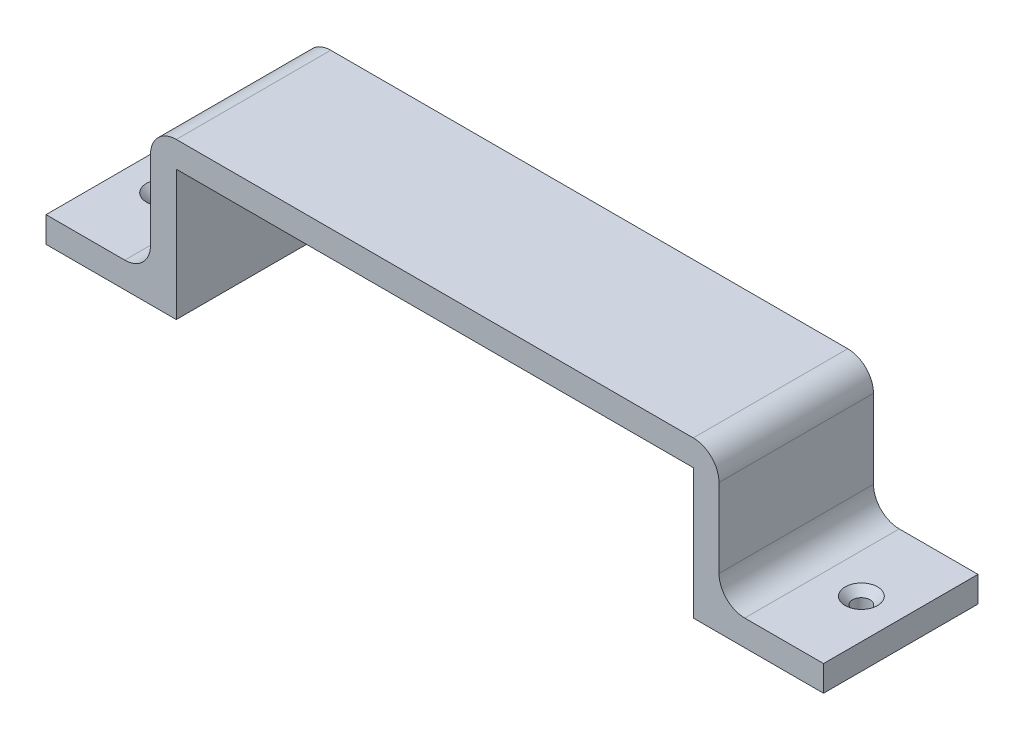
ISO-10303-21;
HEADER;
FILE_DESCRIPTION(('STEP AP214'),'2;1');
FILE_NAME('part.step','',(''),(''),'','','');
FILE_SCHEMA(('AUTOMOTIVE_DESIGN { 1 0 10303 214 1 1 1 1 }'));
ENDSEC;
DATA;
#1=APPLICATION_CONTEXT('core data for automotive mechanical design processes');
#2=APPLICATION_PROTOCOL_DEFINITION('international standard','automotive_design',2000,#1);
#3=PRODUCT_CONTEXT('',#1,'mechanical');
#4=PRODUCT('Part','Part','',(#3));
#5=PRODUCT_RELATED_PRODUCT_CATEGORY('part','',(#4));
#6=PRODUCT_DEFINITION_FORMATION('','',#4);
#7=PRODUCT_DEFINITION_CONTEXT('part definition',#1,'design');
#8=PRODUCT_DEFINITION('design','',#6,#7);
#9=PRODUCT_DEFINITION_SHAPE('','',#8);
#10=(LENGTH_UNIT() NAMED_UNIT(*) SI_UNIT(.MILLI.,.METRE.));
#11=(NAMED_UNIT(*) PLANE_ANGLE_UNIT() SI_UNIT($,.RADIAN.));
#12=(NAMED_UNIT(*) SI_UNIT($,.STERADIAN.) SOLID_ANGLE_UNIT());
#13=UNCERTAINTY_MEASURE_WITH_UNIT(LENGTH_MEASURE(1.E-05),#10,'distance_accuracy_value','');
#14=(GEOMETRIC_REPRESENTATION_CONTEXT(3) GLOBAL_UNCERTAINTY_ASSIGNED_CONTEXT((#13)) GLOBAL_UNIT_ASSIGNED_CONTEXT((#10,
#11,#12)) REPRESENTATION_CONTEXT('',''));
#15=CARTESIAN_POINT('',(0.,0.,0.));
#16=DIRECTION('',(0.,0.,1.));
#17=DIRECTION('',(1.,0.,0.));
#18=AXIS2_PLACEMENT_3D('',#15,#16,#17);
#19=CARTESIAN_POINT('',(-50.2,-25.3,30.));
#20=DIRECTION('',(0.,1.,0.));
#21=DIRECTION('',(-1.,0.,0.));
#22=AXIS2_PLACEMENT_3D('',#19,#20,#21);
#23=PLANE('',#22);
#24=CARTESIAN_POINT('',(-67.85,-25.3,15.));
#25=DIRECTION('',(0.,1.,0.));
#26=DIRECTION('',(0.,0.,1.));
#27=AXIS2_PLACEMENT_3D('',#24,#25,#26);
#28=CIRCLE('',#27,1.69999999999999);
#29=CARTESIAN_POINT('',(-67.85,-25.3,16.7));
#30=VERTEX_POINT('',#29);
#31=EDGE_CURVE('E309',#30,#30,#28,.T.);
#32=ORIENTED_EDGE('',*,*,#31,.T.);
#33=EDGE_LOOP('',(#32));
#34=FACE_BOUND('',#33,.T.);
#35=DIRECTION('',(1.,0.,0.));
#36=VECTOR('',#35,1.);
#37=CARTESIAN_POINT('',(-50.2,-25.3,0.));
#38=LINE('',#37,#36);
#39=CARTESIAN_POINT('',(-75.5,-25.3,0.));
#40=VERTEX_POINT('',#39);
#41=CARTESIAN_POINT('',(-50.2,-25.3,0.));
#42=VERTEX_POINT('',#41);
#43=EDGE_CURVE('E169',#40,#42,#38,.T.);
#44=ORIENTED_EDGE('',*,*,#43,.T.);
#45=DIRECTION('',(0.,0.,-1.));
#46=VECTOR('',#45,1.);
#47=CARTESIAN_POINT('',(-50.2,-25.3,30.));
#48=LINE('',#47,#46);
#49=CARTESIAN_POINT('',(-50.2,-25.3,30.));
#50=VERTEX_POINT('',#49);
#51=EDGE_CURVE('E151',#50,#42,#48,.T.);
#52=ORIENTED_EDGE('',*,*,#51,.F.);
#53=DIRECTION('',(1.,0.,0.));
#54=VECTOR('',#53,1.);
#55=CARTESIAN_POINT('',(-50.2,-25.3,30.));
#56=LINE('',#55,#54);
#57=CARTESIAN_POINT('',(-75.5,-25.3,30.));
#58=VERTEX_POINT('',#57);
#59=EDGE_CURVE('E157',#58,#50,#56,.T.);
#60=ORIENTED_EDGE('',*,*,#59,.F.);
#61=DIRECTION('',(0.,0.,-1.));
#62=VECTOR('',#61,1.);
#63=CARTESIAN_POINT('',(-75.5,-25.3,30.));
#64=LINE('',#63,#62);
#65=EDGE_CURVE('E247',#58,#40,#64,.T.);
#66=ORIENTED_EDGE('',*,*,#65,.T.);
#67=EDGE_LOOP('',(#44,#52,#60,#66));
#68=FACE_BOUND('',#67,.T.);
#69=ADVANCED_FACE('F33',(#34,#68),#23,.F.);
#70=CARTESIAN_POINT('',(-50.2,0.,30.));
#71=DIRECTION('',(-1.,0.,0.));
#72=DIRECTION('',(0.,0.,1.));
#73=AXIS2_PLACEMENT_3D('',#70,#71,#72);
#74=PLANE('',#73);
#75=DIRECTION('',(0.,1.,0.));
#76=VECTOR('',#75,1.);
#77=CARTESIAN_POINT('',(-50.2,0.,0.));
#78=LINE('',#77,#76);
#79=CARTESIAN_POINT('',(-50.2,0.,0.));
#80=VERTEX_POINT('',#79);
#81=EDGE_CURVE('E249',#42,#80,#78,.T.);
#82=ORIENTED_EDGE('',*,*,#81,.T.);
#83=DIRECTION('',(0.,0.,-1.));
#84=VECTOR('',#83,1.);
#85=CARTESIAN_POINT('',(-50.2,0.,30.));
#86=LINE('',#85,#84);
#87=CARTESIAN_POINT('',(-50.2,0.,30.));
#88=VERTEX_POINT('',#87);
#89=EDGE_CURVE('E154',#88,#80,#86,.T.);
#90=ORIENTED_EDGE('',*,*,#89,.F.);
#91=DIRECTION('',(0.,1.,0.));
#92=VECTOR('',#91,1.);
#93=CARTESIAN_POINT('',(-50.2,0.,30.));
#94=LINE('',#93,#92);
#95=EDGE_CURVE('E147',#50,#88,#94,.T.);
#96=ORIENTED_EDGE('',*,*,#95,.F.);
#97=ORIENTED_EDGE('',*,*,#51,.T.);
#98=EDGE_LOOP('',(#82,#90,#96,#97));
#99=FACE_BOUND('',#98,.T.);
#100=ADVANCED_FACE('F149',(#99),#74,.F.);
#101=CARTESIAN_POINT('',(-50.2,0.,30.));
#102=DIRECTION('',(0.,1.,0.));
#103=DIRECTION('',(0.,0.,1.));
#104=AXIS2_PLACEMENT_3D('',#101,#102,#103);
#105=PLANE('',#104);
#106=DIRECTION('',(1.,0.,0.));
#107=VECTOR('',#106,1.);
#108=CARTESIAN_POINT('',(-50.2,0.,0.));
#109=LINE('',#108,#107);
#110=CARTESIAN_POINT('',(50.2,0.,0.));
#111=VERTEX_POINT('',#110);
#112=EDGE_CURVE('E252',#80,#111,#109,.T.);
#113=ORIENTED_EDGE('',*,*,#112,.T.);
#114=DIRECTION('',(0.,0.,-1.));
#115=VECTOR('',#114,1.);
#116=CARTESIAN_POINT('',(50.2,0.,30.));
#117=LINE('',#116,#115);
#118=CARTESIAN_POINT('',(50.2,0.,30.));
#119=VERTEX_POINT('',#118);
#120=EDGE_CURVE('E175',#119,#111,#117,.T.);
#121=ORIENTED_EDGE('',*,*,#120,.F.);
#122=DIRECTION('',(1.,0.,0.));
#123=VECTOR('',#122,1.);
#124=CARTESIAN_POINT('',(-50.2,0.,30.));
#125=LINE('',#124,#123);
#126=EDGE_CURVE('E156',#88,#119,#125,.T.);
#127=ORIENTED_EDGE('',*,*,#126,.F.);
#128=ORIENTED_EDGE('',*,*,#89,.T.);
#129=EDGE_LOOP('',(#113,#121,#127,#128));
#130=FACE_BOUND('',#129,.T.);
#131=ADVANCED_FACE('F359',(#130),#105,.F.);
#132=CARTESIAN_POINT('',(50.2,0.,30.));
#133=DIRECTION('',(1.,0.,0.));
#134=DIRECTION('',(0.,0.,-1.));
#135=AXIS2_PLACEMENT_3D('',#132,#133,#134);
#136=PLANE('',#135);
#137=DIRECTION('',(0.,-1.,0.));
#138=VECTOR('',#137,1.);
#139=CARTESIAN_POINT('',(50.2,0.,0.));
#140=LINE('',#139,#138);
#141=CARTESIAN_POINT('',(50.2,-25.3,0.));
#142=VERTEX_POINT('',#141);
#143=EDGE_CURVE('E254',#111,#142,#140,.T.);
#144=ORIENTED_EDGE('',*,*,#143,.T.);
#145=DIRECTION('',(0.,0.,-1.));
#146=VECTOR('',#145,1.);
#147=CARTESIAN_POINT('',(50.2,-25.3,30.));
#148=LINE('',#147,#146);
#149=CARTESIAN_POINT('',(50.2,-25.3,30.));
#150=VERTEX_POINT('',#149);
#151=EDGE_CURVE('E276',#150,#142,#148,.T.);
#152=ORIENTED_EDGE('',*,*,#151,.F.);
#153=DIRECTION('',(0.,-1.,0.));
#154=VECTOR('',#153,1.);
#155=CARTESIAN_POINT('',(50.2,0.,30.));
#156=LINE('',#155,#154);
#157=EDGE_CURVE('E285',#119,#150,#156,.T.);
#158=ORIENTED_EDGE('',*,*,#157,.F.);
#159=ORIENTED_EDGE('',*,*,#120,.T.);
#160=EDGE_LOOP('',(#144,#152,#158,#159));
#161=FACE_BOUND('',#160,.T.);
#162=ADVANCED_FACE('F283',(#161),#136,.F.);
#163=CARTESIAN_POINT('',(50.2,-25.3,30.));
#164=DIRECTION('',(0.,1.,0.));
#165=DIRECTION('',(-1.,0.,0.));
#166=AXIS2_PLACEMENT_3D('',#163,#164,#165);
#167=PLANE('',#166);
#168=CARTESIAN_POINT('',(67.85,-25.3,15.));
#169=DIRECTION('',(0.,1.,0.));
#170=DIRECTION('',(0.,0.,1.));
#171=AXIS2_PLACEMENT_3D('',#168,#169,#170);
#172=CIRCLE('',#171,1.69999999999999);
#173=CARTESIAN_POINT('',(67.85,-25.3,16.7));
#174=VERTEX_POINT('',#173);
#175=EDGE_CURVE('E250',#174,#174,#172,.T.);
#176=ORIENTED_EDGE('',*,*,#175,.T.);
#177=EDGE_LOOP('',(#176));
#178=FACE_BOUND('',#177,.T.);
#179=DIRECTION('',(1.,0.,0.));
#180=VECTOR('',#179,1.);
#181=CARTESIAN_POINT('',(50.2,-25.3,0.));
#182=LINE('',#181,#180);
#183=CARTESIAN_POINT('',(75.5,-25.3,0.));
#184=VERTEX_POINT('',#183);
#185=EDGE_CURVE('E256',#142,#184,#182,.T.);
#186=ORIENTED_EDGE('',*,*,#185,.T.);
#187=DIRECTION('',(0.,0.,-1.));
#188=VECTOR('',#187,1.);
#189=CARTESIAN_POINT('',(75.5,-25.3,30.));
#190=LINE('',#189,#188);
#191=CARTESIAN_POINT('',(75.5,-25.3,30.));
#192=VERTEX_POINT('',#191);
#193=EDGE_CURVE('E273',#192,#184,#190,.T.);
#194=ORIENTED_EDGE('',*,*,#193,.F.);
#195=DIRECTION('',(1.,0.,0.));
#196=VECTOR('',#195,1.);
#197=CARTESIAN_POINT('',(50.2,-25.3,30.));
#198=LINE('',#197,#196);
#199=EDGE_CURVE('E296',#150,#192,#198,.T.);
#200=ORIENTED_EDGE('',*,*,#199,.F.);
#201=ORIENTED_EDGE('',*,*,#151,.T.);
#202=EDGE_LOOP('',(#186,#194,#200,#201));
#203=FACE_BOUND('',#202,.T.);
#204=ADVANCED_FACE('F291',(#178,#203),#167,.F.);
#205=CARTESIAN_POINT('',(75.5,-25.3,30.));
#206=DIRECTION('',(-1.,0.,0.));
#207=DIRECTION('',(0.,0.,1.));
#208=AXIS2_PLACEMENT_3D('',#205,#206,#207);
#209=PLANE('',#208);
#210=DIRECTION('',(0.,1.,0.));
#211=VECTOR('',#210,1.);
#212=CARTESIAN_POINT('',(75.5,-25.3,0.));
#213=LINE('',#212,#211);
#214=CARTESIAN_POINT('',(75.5,-20.3,0.));
#215=VERTEX_POINT('',#214);
#216=EDGE_CURVE('E224',#184,#215,#213,.T.);
#217=ORIENTED_EDGE('',*,*,#216,.T.);
#218=DIRECTION('',(0.,0.,-1.));
#219=VECTOR('',#218,1.);
#220=CARTESIAN_POINT('',(75.5,-20.3,30.));
#221=LINE('',#220,#219);
#222=CARTESIAN_POINT('',(75.5,-20.3,30.));
#223=VERTEX_POINT('',#222);
#224=EDGE_CURVE('E223',#223,#215,#221,.T.);
#225=ORIENTED_EDGE('',*,*,#224,.F.);
#226=DIRECTION('',(0.,1.,0.));
#227=VECTOR('',#226,1.);
#228=CARTESIAN_POINT('',(75.5,-25.3,30.));
#229=LINE('',#228,#227);
#230=EDGE_CURVE('E238',#192,#223,#229,.T.);
#231=ORIENTED_EDGE('',*,*,#230,.F.);
#232=ORIENTED_EDGE('',*,*,#193,.T.);
#233=EDGE_LOOP('',(#217,#225,#231,#232));
#234=FACE_BOUND('',#233,.T.);
#235=ADVANCED_FACE('F295',(#234),#209,.F.);
#236=CARTESIAN_POINT('',(55.2,-20.3,30.));
#237=DIRECTION('',(0.,-1.,0.));
#238=DIRECTION('',(0.,0.,-1.));
#239=AXIS2_PLACEMENT_3D('',#236,#237,#238);
#240=PLANE('',#239);
#241=CARTESIAN_POINT('',(67.85,-20.3,15.));
#242=DIRECTION('',(0.,1.,0.));
#243=DIRECTION('',(0.,0.,1.));
#244=AXIS2_PLACEMENT_3D('',#241,#242,#243);
#245=CIRCLE('',#244,3.15);
#246=CARTESIAN_POINT('',(67.85,-20.3,18.15));
#247=VERTEX_POINT('',#246);
#248=EDGE_CURVE('E306',#247,#247,#245,.T.);
#249=ORIENTED_EDGE('',*,*,#248,.F.);
#250=EDGE_LOOP('',(#249));
#251=FACE_BOUND('',#250,.T.);
#252=DIRECTION('',(-1.,0.,0.));
#253=VECTOR('',#252,1.);
#254=CARTESIAN_POINT('',(55.2,-20.3,0.));
#255=LINE('',#254,#253);
#256=CARTESIAN_POINT('',(60.2,-20.3,0.));
#257=VERTEX_POINT('',#256);
#258=EDGE_CURVE('E211',#215,#257,#255,.T.);
#259=ORIENTED_EDGE('',*,*,#258,.T.);
#260=DIRECTION('',(0.,0.,-1.));
#261=VECTOR('',#260,1.);
#262=CARTESIAN_POINT('',(60.2,-20.3,30.));
#263=LINE('',#262,#261);
#264=CARTESIAN_POINT('',(60.2,-20.3,30.));
#265=VERTEX_POINT('',#264);
#266=EDGE_CURVE('E188',#257,#265,#263,.F.);
#267=ORIENTED_EDGE('',*,*,#266,.T.);
#268=DIRECTION('',(-1.,0.,0.));
#269=VECTOR('',#268,1.);
#270=CARTESIAN_POINT('',(55.2,-20.3,30.));
#271=LINE('',#270,#269);
#272=EDGE_CURVE('E230',#223,#265,#271,.T.);
#273=ORIENTED_EDGE('',*,*,#272,.F.);
#274=ORIENTED_EDGE('',*,*,#224,.T.);
#275=EDGE_LOOP('',(#259,#267,#273,#274));
#276=FACE_BOUND('',#275,.T.);
#277=ADVANCED_FACE('F219',(#251,#276),#240,.F.);
#278=CARTESIAN_POINT('',(55.2,5.,30.));
#279=DIRECTION('',(-1.,0.,0.));
#280=DIRECTION('',(0.,0.,1.));
#281=AXIS2_PLACEMENT_3D('',#278,#279,#280);
#282=PLANE('',#281);
#283=DIRECTION('',(0.,1.,0.));
#284=VECTOR('',#283,1.);
#285=CARTESIAN_POINT('',(55.2,5.,30.));
#286=LINE('',#285,#284);
#287=CARTESIAN_POINT('',(55.2,-15.3,30.));
#288=VERTEX_POINT('',#287);
#289=CARTESIAN_POINT('',(55.2,0.,30.));
#290=VERTEX_POINT('',#289);
#291=EDGE_CURVE('E229',#288,#290,#286,.T.);
#292=ORIENTED_EDGE('',*,*,#291,.F.);
#293=DIRECTION('',(0.,0.,-1.));
#294=VECTOR('',#293,1.);
#295=CARTESIAN_POINT('',(55.2,-15.3,0.));
#296=LINE('',#295,#294);
#297=CARTESIAN_POINT('',(55.2,-15.3,0.));
#298=VERTEX_POINT('',#297);
#299=EDGE_CURVE('E185',#288,#298,#296,.T.);
#300=ORIENTED_EDGE('',*,*,#299,.T.);
#301=DIRECTION('',(0.,1.,0.));
#302=VECTOR('',#301,1.);
#303=CARTESIAN_POINT('',(55.2,5.,0.));
#304=LINE('',#303,#302);
#305=CARTESIAN_POINT('',(55.2,0.,0.));
#306=VERTEX_POINT('',#305);
#307=EDGE_CURVE('E213',#298,#306,#304,.T.);
#308=ORIENTED_EDGE('',*,*,#307,.T.);
#309=DIRECTION('',(0.,0.,-1.));
#310=VECTOR('',#309,1.);
#311=CARTESIAN_POINT('',(55.2,0.,30.));
#312=LINE('',#311,#310);
#313=EDGE_CURVE('E183',#306,#290,#312,.F.);
#314=ORIENTED_EDGE('',*,*,#313,.T.);
#315=EDGE_LOOP('',(#292,#300,#308,#314));
#316=FACE_BOUND('',#315,.T.);
#317=ADVANCED_FACE('F232',(#316),#282,.F.);
#318=CARTESIAN_POINT('',(-55.2,5.,30.));
#319=DIRECTION('',(0.,-1.,0.));
#320=DIRECTION('',(0.,0.,-1.));
#321=AXIS2_PLACEMENT_3D('',#318,#319,#320);
#322=PLANE('',#321);
#323=DIRECTION('',(-1.,0.,0.));
#324=VECTOR('',#323,1.);
#325=CARTESIAN_POINT('',(-55.2,5.,30.));
#326=LINE('',#325,#324);
#327=CARTESIAN_POINT('',(50.2,5.,30.));
#328=VERTEX_POINT('',#327);
#329=CARTESIAN_POINT('',(-50.2,5.,30.));
#330=VERTEX_POINT('',#329);
#331=EDGE_CURVE('E234',#328,#330,#326,.T.);
#332=ORIENTED_EDGE('',*,*,#331,.F.);
#333=DIRECTION('',(0.,0.,-1.));
#334=VECTOR('',#333,1.);
#335=CARTESIAN_POINT('',(50.2,5.,30.));
#336=LINE('',#335,#334);
#337=CARTESIAN_POINT('',(50.2,5.,0.));
#338=VERTEX_POINT('',#337);
#339=EDGE_CURVE('E191',#328,#338,#336,.T.);
#340=ORIENTED_EDGE('',*,*,#339,.T.);
#341=DIRECTION('',(-1.,0.,0.));
#342=VECTOR('',#341,1.);
#343=CARTESIAN_POINT('',(-55.2,5.,0.));
#344=LINE('',#343,#342);
#345=CARTESIAN_POINT('',(-50.2,5.,0.));
#346=VERTEX_POINT('',#345);
#347=EDGE_CURVE('E260',#338,#346,#344,.T.);
#348=ORIENTED_EDGE('',*,*,#347,.T.);
#349=DIRECTION('',(0.,0.,-1.));
#350=VECTOR('',#349,1.);
#351=CARTESIAN_POINT('',(-50.2,5.,30.));
#352=LINE('',#351,#350);
#353=EDGE_CURVE('E48',#346,#330,#352,.F.);
#354=ORIENTED_EDGE('',*,*,#353,.T.);
#355=EDGE_LOOP('',(#332,#340,#348,#354));
#356=FACE_BOUND('',#355,.T.);
#357=ADVANCED_FACE('F342',(#356),#322,.F.);
#358=CARTESIAN_POINT('',(-55.2,5.,30.));
#359=DIRECTION('',(1.,0.,0.));
#360=DIRECTION('',(0.,0.,-1.));
#361=AXIS2_PLACEMENT_3D('',#358,#359,#360);
#362=PLANE('',#361);
#363=DIRECTION('',(0.,-1.,0.));
#364=VECTOR('',#363,1.);
#365=CARTESIAN_POINT('',(-55.2,5.,0.));
#366=LINE('',#365,#364);
#367=CARTESIAN_POINT('',(-55.2,0.,0.));
#368=VERTEX_POINT('',#367);
#369=CARTESIAN_POINT('',(-55.2,-15.3,0.));
#370=VERTEX_POINT('',#369);
#371=EDGE_CURVE('E262',#368,#370,#366,.T.);
#372=ORIENTED_EDGE('',*,*,#371,.T.);
#373=DIRECTION('',(0.,0.,-1.));
#374=VECTOR('',#373,1.);
#375=CARTESIAN_POINT('',(-55.2,-15.3,30.));
#376=LINE('',#375,#374);
#377=CARTESIAN_POINT('',(-55.2,-15.3,30.));
#378=VERTEX_POINT('',#377);
#379=EDGE_CURVE('E181',#370,#378,#376,.F.);
#380=ORIENTED_EDGE('',*,*,#379,.T.);
#381=DIRECTION('',(0.,-1.,0.));
#382=VECTOR('',#381,1.);
#383=CARTESIAN_POINT('',(-55.2,5.,30.));
#384=LINE('',#383,#382);
#385=CARTESIAN_POINT('',(-55.2,0.,30.));
#386=VERTEX_POINT('',#385);
#387=EDGE_CURVE('E236',#386,#378,#384,.T.);
#388=ORIENTED_EDGE('',*,*,#387,.F.);
#389=DIRECTION('',(0.,0.,-1.));
#390=VECTOR('',#389,1.);
#391=CARTESIAN_POINT('',(-55.2,0.,30.));
#392=LINE('',#391,#390);
#393=EDGE_CURVE('E173',#386,#368,#392,.T.);
#394=ORIENTED_EDGE('',*,*,#393,.T.);
#395=EDGE_LOOP('',(#372,#380,#388,#394));
#396=FACE_BOUND('',#395,.T.);
#397=ADVANCED_FACE('F325',(#396),#362,.F.);
#398=CARTESIAN_POINT('',(-55.2,-20.3,30.));
#399=DIRECTION('',(0.,-1.,0.));
#400=DIRECTION('',(0.,0.,-1.));
#401=AXIS2_PLACEMENT_3D('',#398,#399,#400);
#402=PLANE('',#401);
#403=CARTESIAN_POINT('',(-67.85,-20.3,15.));
#404=DIRECTION('',(0.,1.,0.));
#405=DIRECTION('',(0.,0.,1.));
#406=AXIS2_PLACEMENT_3D('',#403,#404,#405);
#407=CIRCLE('',#406,3.15);
#408=CARTESIAN_POINT('',(-67.85,-20.3,18.15));
#409=VERTEX_POINT('',#408);
#410=EDGE_CURVE('E315',#409,#409,#407,.T.);
#411=ORIENTED_EDGE('',*,*,#410,.F.);
#412=EDGE_LOOP('',(#411));
#413=FACE_BOUND('',#412,.T.);
#414=DIRECTION('',(-1.,0.,0.));
#415=VECTOR('',#414,1.);
#416=CARTESIAN_POINT('',(-55.2,-20.3,30.));
#417=LINE('',#416,#415);
#418=CARTESIAN_POINT('',(-60.2,-20.3,30.));
#419=VERTEX_POINT('',#418);
#420=CARTESIAN_POINT('',(-75.5,-20.3,30.));
#421=VERTEX_POINT('',#420);
#422=EDGE_CURVE('E244',#419,#421,#417,.T.);
#423=ORIENTED_EDGE('',*,*,#422,.F.);
#424=DIRECTION('',(0.,0.,-1.));
#425=VECTOR('',#424,1.);
#426=CARTESIAN_POINT('',(-60.2,-20.3,0.));
#427=LINE('',#426,#425);
#428=CARTESIAN_POINT('',(-60.2,-20.3,0.));
#429=VERTEX_POINT('',#428);
#430=EDGE_CURVE('E170',#419,#429,#427,.T.);
#431=ORIENTED_EDGE('',*,*,#430,.T.);
#432=DIRECTION('',(-1.,0.,0.));
#433=VECTOR('',#432,1.);
#434=CARTESIAN_POINT('',(-55.2,-20.3,0.));
#435=LINE('',#434,#433);
#436=CARTESIAN_POINT('',(-75.5,-20.3,0.));
#437=VERTEX_POINT('',#436);
#438=EDGE_CURVE('E265',#429,#437,#435,.T.);
#439=ORIENTED_EDGE('',*,*,#438,.T.);
#440=DIRECTION('',(0.,0.,-1.));
#441=VECTOR('',#440,1.);
#442=CARTESIAN_POINT('',(-75.5,-20.3,30.));
#443=LINE('',#442,#441);
#444=EDGE_CURVE('E269',#421,#437,#443,.T.);
#445=ORIENTED_EDGE('',*,*,#444,.F.);
#446=EDGE_LOOP('',(#423,#431,#439,#445));
#447=FACE_BOUND('',#446,.T.);
#448=ADVANCED_FACE('F321',(#413,#447),#402,.F.);
#449=CARTESIAN_POINT('',(-75.5,-25.3,30.));
#450=DIRECTION('',(1.,0.,0.));
#451=DIRECTION('',(0.,0.,-1.));
#452=AXIS2_PLACEMENT_3D('',#449,#450,#451);
#453=PLANE('',#452);
#454=DIRECTION('',(0.,-1.,0.));
#455=VECTOR('',#454,1.);
#456=CARTESIAN_POINT('',(-75.5,-25.3,0.));
#457=LINE('',#456,#455);
#458=EDGE_CURVE('E166',#437,#40,#457,.T.);
#459=ORIENTED_EDGE('',*,*,#458,.T.);
#460=ORIENTED_EDGE('',*,*,#65,.F.);
#461=DIRECTION('',(0.,-1.,0.));
#462=VECTOR('',#461,1.);
#463=CARTESIAN_POINT('',(-75.5,-25.3,30.));
#464=LINE('',#463,#462);
#465=EDGE_CURVE('E162',#421,#58,#464,.T.);
#466=ORIENTED_EDGE('',*,*,#465,.F.);
#467=ORIENTED_EDGE('',*,*,#444,.T.);
#468=EDGE_LOOP('',(#459,#460,#466,#467));
#469=FACE_BOUND('',#468,.T.);
#470=ADVANCED_FACE('F324',(#469),#453,.F.);
#471=CARTESIAN_POINT('',(0.,0.,30.));
#472=DIRECTION('',(0.,0.,-1.));
#473=DIRECTION('',(-1.,0.,0.));
#474=AXIS2_PLACEMENT_3D('',#471,#472,#473);
#475=PLANE('',#474);
#476=ORIENTED_EDGE('',*,*,#291,.T.);
#477=CARTESIAN_POINT('',(50.2,0.,30.));
#478=DIRECTION('',(0.,0.,-1.));
#479=DIRECTION('',(-1.,0.,0.));
#480=AXIS2_PLACEMENT_3D('',#477,#478,#479);
#481=CIRCLE('',#480,5.);
#482=EDGE_CURVE('E55',#290,#328,#481,.F.);
#483=ORIENTED_EDGE('',*,*,#482,.T.);
#484=ORIENTED_EDGE('',*,*,#331,.T.);
#485=CARTESIAN_POINT('',(-50.2,0.,30.));
#486=DIRECTION('',(0.,0.,-1.));
#487=DIRECTION('',(-1.,0.,0.));
#488=AXIS2_PLACEMENT_3D('',#485,#486,#487);
#489=CIRCLE('',#488,5.);
#490=EDGE_CURVE('E198',#330,#386,#489,.F.);
#491=ORIENTED_EDGE('',*,*,#490,.T.);
#492=ORIENTED_EDGE('',*,*,#387,.T.);
#493=CARTESIAN_POINT('',(-60.2,-15.3,30.));
#494=DIRECTION('',(0.,0.,-1.));
#495=DIRECTION('',(-1.,0.,0.));
#496=AXIS2_PLACEMENT_3D('',#493,#494,#495);
#497=CIRCLE('',#496,5.);
#498=EDGE_CURVE('E203',#378,#419,#497,.T.);
#499=ORIENTED_EDGE('',*,*,#498,.T.);
#500=ORIENTED_EDGE('',*,*,#422,.T.);
#501=ORIENTED_EDGE('',*,*,#465,.T.);
#502=ORIENTED_EDGE('',*,*,#59,.T.);
#503=ORIENTED_EDGE('',*,*,#95,.T.);
#504=ORIENTED_EDGE('',*,*,#126,.T.);
#505=ORIENTED_EDGE('',*,*,#157,.T.);
#506=ORIENTED_EDGE('',*,*,#199,.T.);
#507=ORIENTED_EDGE('',*,*,#230,.T.);
#508=ORIENTED_EDGE('',*,*,#272,.T.);
#509=CARTESIAN_POINT('',(60.2,-15.3,30.));
#510=DIRECTION('',(0.,0.,-1.));
#511=DIRECTION('',(-1.,0.,0.));
#512=AXIS2_PLACEMENT_3D('',#509,#510,#511);
#513=CIRCLE('',#512,5.);
#514=EDGE_CURVE('E11',#265,#288,#513,.T.);
#515=ORIENTED_EDGE('',*,*,#514,.T.);
#516=EDGE_LOOP('',(#476,#483,#484,#491,#492,#499,#500,#501,#502,#503,#504,#505,#506,#507,#508,#515));
#517=FACE_BOUND('',#516,.T.);
#518=ADVANCED_FACE('F160',(#517),#475,.F.);
#519=CARTESIAN_POINT('',(0.,0.,0.));
#520=DIRECTION('',(0.,0.,-1.));
#521=DIRECTION('',(-1.,0.,0.));
#522=AXIS2_PLACEMENT_3D('',#519,#520,#521);
#523=PLANE('',#522);
#524=ORIENTED_EDGE('',*,*,#347,.F.);
#525=CARTESIAN_POINT('',(50.2,0.,0.));
#526=DIRECTION('',(0.,0.,-1.));
#527=DIRECTION('',(-1.,0.,0.));
#528=AXIS2_PLACEMENT_3D('',#525,#526,#527);
#529=CIRCLE('',#528,5.);
#530=EDGE_CURVE('E196',#338,#306,#529,.T.);
#531=ORIENTED_EDGE('',*,*,#530,.T.);
#532=ORIENTED_EDGE('',*,*,#307,.F.);
#533=CARTESIAN_POINT('',(60.2,-15.3,0.));
#534=DIRECTION('',(0.,0.,-1.));
#535=DIRECTION('',(-1.,0.,0.));
#536=AXIS2_PLACEMENT_3D('',#533,#534,#535);
#537=CIRCLE('',#536,5.);
#538=EDGE_CURVE('E41',#298,#257,#537,.F.);
#539=ORIENTED_EDGE('',*,*,#538,.T.);
#540=ORIENTED_EDGE('',*,*,#258,.F.);
#541=ORIENTED_EDGE('',*,*,#216,.F.);
#542=ORIENTED_EDGE('',*,*,#185,.F.);
#543=ORIENTED_EDGE('',*,*,#143,.F.);
#544=ORIENTED_EDGE('',*,*,#112,.F.);
#545=ORIENTED_EDGE('',*,*,#81,.F.);
#546=ORIENTED_EDGE('',*,*,#43,.F.);
#547=ORIENTED_EDGE('',*,*,#458,.F.);
#548=ORIENTED_EDGE('',*,*,#438,.F.);
#549=CARTESIAN_POINT('',(-60.2,-15.3,0.));
#550=DIRECTION('',(0.,0.,-1.));
#551=DIRECTION('',(-1.,0.,0.));
#552=AXIS2_PLACEMENT_3D('',#549,#550,#551);
#553=CIRCLE('',#552,5.);
#554=EDGE_CURVE('E201',#429,#370,#553,.F.);
#555=ORIENTED_EDGE('',*,*,#554,.T.);
#556=ORIENTED_EDGE('',*,*,#371,.F.);
#557=CARTESIAN_POINT('',(-50.2,0.,0.));
#558=DIRECTION('',(0.,0.,-1.));
#559=DIRECTION('',(-1.,0.,0.));
#560=AXIS2_PLACEMENT_3D('',#557,#558,#559);
#561=CIRCLE('',#560,5.);
#562=EDGE_CURVE('E194',#368,#346,#561,.T.);
#563=ORIENTED_EDGE('',*,*,#562,.T.);
#564=EDGE_LOOP('',(#524,#531,#532,#539,#540,#541,#542,#543,#544,#545,#546,#547,#548,#555,#556,#563));
#565=FACE_BOUND('',#564,.T.);
#566=ADVANCED_FACE('F209',(#565),#523,.T.);
#567=CARTESIAN_POINT('',(-60.2,-15.3,30.));
#568=DIRECTION('',(0.,0.,1.));
#569=DIRECTION('',(1.,0.,0.));
#570=AXIS2_PLACEMENT_3D('',#567,#568,#569);
#571=CYLINDRICAL_SURFACE('',#570,5.);
#572=ORIENTED_EDGE('',*,*,#498,.F.);
#573=ORIENTED_EDGE('',*,*,#379,.F.);
#574=ORIENTED_EDGE('',*,*,#554,.F.);
#575=ORIENTED_EDGE('',*,*,#430,.F.);
#576=EDGE_LOOP('',(#572,#573,#574,#575));
#577=FACE_BOUND('',#576,.T.);
#578=ADVANCED_FACE('F333',(#577),#571,.F.);
#579=CARTESIAN_POINT('',(60.2,-15.3,30.));
#580=DIRECTION('',(0.,0.,1.));
#581=DIRECTION('',(1.,0.,0.));
#582=AXIS2_PLACEMENT_3D('',#579,#580,#581);
#583=CYLINDRICAL_SURFACE('',#582,5.);
#584=ORIENTED_EDGE('',*,*,#514,.F.);
#585=ORIENTED_EDGE('',*,*,#266,.F.);
#586=ORIENTED_EDGE('',*,*,#538,.F.);
#587=ORIENTED_EDGE('',*,*,#299,.F.);
#588=EDGE_LOOP('',(#584,#585,#586,#587));
#589=FACE_BOUND('',#588,.T.);
#590=ADVANCED_FACE('F227',(#589),#583,.F.);
#591=CARTESIAN_POINT('',(50.2,0.,30.));
#592=DIRECTION('',(0.,0.,-1.));
#593=DIRECTION('',(-1.,0.,0.));
#594=AXIS2_PLACEMENT_3D('',#591,#592,#593);
#595=CYLINDRICAL_SURFACE('',#594,5.);
#596=ORIENTED_EDGE('',*,*,#482,.F.);
#597=ORIENTED_EDGE('',*,*,#313,.F.);
#598=ORIENTED_EDGE('',*,*,#530,.F.);
#599=ORIENTED_EDGE('',*,*,#339,.F.);
#600=EDGE_LOOP('',(#596,#597,#598,#599));
#601=FACE_BOUND('',#600,.T.);
#602=ADVANCED_FACE('F345',(#601),#595,.T.);
#603=CARTESIAN_POINT('',(-50.2,0.,30.));
#604=DIRECTION('',(0.,0.,-1.));
#605=DIRECTION('',(-1.,0.,0.));
#606=AXIS2_PLACEMENT_3D('',#603,#604,#605);
#607=CYLINDRICAL_SURFACE('',#606,5.);
#608=ORIENTED_EDGE('',*,*,#490,.F.);
#609=ORIENTED_EDGE('',*,*,#353,.F.);
#610=ORIENTED_EDGE('',*,*,#562,.F.);
#611=ORIENTED_EDGE('',*,*,#393,.F.);
#612=EDGE_LOOP('',(#608,#609,#610,#611));
#613=FACE_BOUND('',#612,.T.);
#614=ADVANCED_FACE('F35',(#613),#607,.T.);
#615=CARTESIAN_POINT('',(67.85,-20.3,15.));
#616=DIRECTION('',(0.,1.,0.));
#617=DIRECTION('',(0.,0.,1.));
#618=AXIS2_PLACEMENT_3D('',#615,#616,#617);
#619=CYLINDRICAL_SURFACE('',#618,1.69999999999999);
#620=ORIENTED_EDGE('',*,*,#175,.F.);
#621=EDGE_LOOP('',(#620));
#622=FACE_BOUND('',#621,.T.);
#623=CARTESIAN_POINT('',(67.85,-21.75,15.));
#624=DIRECTION('',(0.,1.,0.));
#625=DIRECTION('',(0.,0.,1.));
#626=AXIS2_PLACEMENT_3D('',#623,#624,#625);
#627=CIRCLE('',#626,1.69999999999999);
#628=CARTESIAN_POINT('',(67.85,-21.75,16.7));
#629=VERTEX_POINT('',#628);
#630=EDGE_CURVE('E303',#629,#629,#627,.T.);
#631=ORIENTED_EDGE('',*,*,#630,.T.);
#632=EDGE_LOOP('',(#631));
#633=FACE_BOUND('',#632,.T.);
#634=ADVANCED_FACE('F351',(#622,#633),#619,.F.);
#635=CARTESIAN_POINT('',(67.85,-20.3,15.));
#636=DIRECTION('',(0.,1.,0.));
#637=DIRECTION('',(0.,0.,1.));
#638=AXIS2_PLACEMENT_3D('',#635,#636,#637);
#639=CONICAL_SURFACE('',#638,3.15,0.785398163397451);
#640=ORIENTED_EDGE('',*,*,#630,.F.);
#641=EDGE_LOOP('',(#640));
#642=FACE_BOUND('',#641,.T.);
#643=ORIENTED_EDGE('',*,*,#248,.T.);
#644=EDGE_LOOP('',(#643));
#645=FACE_BOUND('',#644,.T.);
#646=ADVANCED_FACE('F498',(#642,#645),#639,.F.);
#647=CARTESIAN_POINT('',(-67.85,-20.3,15.));
#648=DIRECTION('',(0.,1.,0.));
#649=DIRECTION('',(0.,0.,1.));
#650=AXIS2_PLACEMENT_3D('',#647,#648,#649);
#651=CYLINDRICAL_SURFACE('',#650,1.69999999999999);
#652=ORIENTED_EDGE('',*,*,#31,.F.);
#653=EDGE_LOOP('',(#652));
#654=FACE_BOUND('',#653,.T.);
#655=CARTESIAN_POINT('',(-67.85,-21.75,15.));
#656=DIRECTION('',(0.,1.,0.));
#657=DIRECTION('',(0.,0.,1.));
#658=AXIS2_PLACEMENT_3D('',#655,#656,#657);
#659=CIRCLE('',#658,1.69999999999999);
#660=CARTESIAN_POINT('',(-67.85,-21.75,16.7));
#661=VERTEX_POINT('',#660);
#662=EDGE_CURVE('E312',#661,#661,#659,.T.);
#663=ORIENTED_EDGE('',*,*,#662,.T.);
#664=EDGE_LOOP('',(#663));
#665=FACE_BOUND('',#664,.T.);
#666=ADVANCED_FACE('F504',(#654,#665),#651,.F.);
#667=CARTESIAN_POINT('',(-67.85,-20.3,15.));
#668=DIRECTION('',(0.,1.,0.));
#669=DIRECTION('',(0.,0.,1.));
#670=AXIS2_PLACEMENT_3D('',#667,#668,#669);
#671=CONICAL_SURFACE('',#670,3.15,0.785398163397451);
#672=ORIENTED_EDGE('',*,*,#662,.F.);
#673=EDGE_LOOP('',(#672));
#674=FACE_BOUND('',#673,.T.);
#675=ORIENTED_EDGE('',*,*,#410,.T.);
#676=EDGE_LOOP('',(#675));
#677=FACE_BOUND('',#676,.T.);
#678=ADVANCED_FACE('F319',(#674,#677),#671,.F.);
#679=CLOSED_SHELL('',(#69,#100,#131,#162,#204,#235,#277,#317,#357,#397,#448,#470,#518,#566,#578,
#590,#602,#614,#634,#646,#666,#678));
#680=MANIFOLD_SOLID_BREP('B2',#679);
#681=ADVANCED_BREP_SHAPE_REPRESENTATION('',(#18,#680),#14);
#682=SHAPE_DEFINITION_REPRESENTATION(#9,#681);
ENDSEC;
END-ISO-10303-21;
